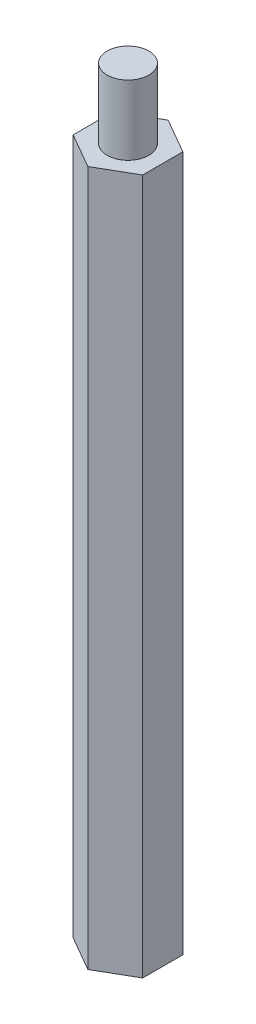
ISO-10303-21;
HEADER;
FILE_DESCRIPTION(('STEP AP214'),'2;1');
FILE_NAME('part.step','',(''),(''),'','','');
FILE_SCHEMA(('AUTOMOTIVE_DESIGN { 1 0 10303 214 1 1 1 1 }'));
ENDSEC;
DATA;
#1=APPLICATION_CONTEXT('core data for automotive mechanical design processes');
#2=APPLICATION_PROTOCOL_DEFINITION('international standard','automotive_design',2000,#1);
#3=PRODUCT_CONTEXT('',#1,'mechanical');
#4=PRODUCT('Part','Part','',(#3));
#5=PRODUCT_RELATED_PRODUCT_CATEGORY('part','',(#4));
#6=PRODUCT_DEFINITION_FORMATION('','',#4);
#7=PRODUCT_DEFINITION_CONTEXT('part definition',#1,'design');
#8=PRODUCT_DEFINITION('design','',#6,#7);
#9=PRODUCT_DEFINITION_SHAPE('','',#8);
#10=(LENGTH_UNIT() NAMED_UNIT(*) SI_UNIT(.MILLI.,.METRE.));
#11=(NAMED_UNIT(*) PLANE_ANGLE_UNIT() SI_UNIT($,.RADIAN.));
#12=(NAMED_UNIT(*) SI_UNIT($,.STERADIAN.) SOLID_ANGLE_UNIT());
#13=UNCERTAINTY_MEASURE_WITH_UNIT(LENGTH_MEASURE(1.E-05),#10,'distance_accuracy_value','');
#14=(GEOMETRIC_REPRESENTATION_CONTEXT(3) GLOBAL_UNCERTAINTY_ASSIGNED_CONTEXT((#13)) GLOBAL_UNIT_ASSIGNED_CONTEXT((#10,
#11,#12)) REPRESENTATION_CONTEXT('',''));
#15=CARTESIAN_POINT('',(0.,0.,0.));
#16=DIRECTION('',(0.,0.,1.));
#17=DIRECTION('',(1.,0.,0.));
#18=AXIS2_PLACEMENT_3D('',#15,#16,#17);
#19=CARTESIAN_POINT('',(-4.99999999999997,100.,2.88675134594819));
#20=DIRECTION('',(0.499999999999995,0.,-0.866025403784442));
#21=DIRECTION('',(-0.866025403784442,0.,-0.499999999999995));
#22=AXIS2_PLACEMENT_3D('',#19,#20,#21);
#23=PLANE('',#22);
#24=DIRECTION('',(0.866025403784442,0.,0.499999999999995));
#25=VECTOR('',#24,1.);
#26=CARTESIAN_POINT('',(-4.99999999999997,0.,2.88675134594819));
#27=LINE('',#26,#25);
#28=CARTESIAN_POINT('',(-4.99999999999997,0.,2.88675134594819));
#29=VERTEX_POINT('',#28);
#30=CARTESIAN_POINT('',(0.,0.,5.77350269189626));
#31=VERTEX_POINT('',#30);
#32=EDGE_CURVE('E117',#29,#31,#27,.T.);
#33=ORIENTED_EDGE('',*,*,#32,.T.);
#34=DIRECTION('',(0.,-1.,0.));
#35=VECTOR('',#34,1.);
#36=CARTESIAN_POINT('',(0.,100.,5.77350269189626));
#37=LINE('',#36,#35);
#38=CARTESIAN_POINT('',(0.,100.,5.77350269189626));
#39=VERTEX_POINT('',#38);
#40=EDGE_CURVE('E11',#39,#31,#37,.T.);
#41=ORIENTED_EDGE('',*,*,#40,.F.);
#42=DIRECTION('',(0.866025403784442,0.,0.499999999999995));
#43=VECTOR('',#42,1.);
#44=CARTESIAN_POINT('',(-4.99999999999997,100.,2.88675134594819));
#45=LINE('',#44,#43);
#46=CARTESIAN_POINT('',(-4.99999999999997,100.,2.88675134594819));
#47=VERTEX_POINT('',#46);
#48=EDGE_CURVE('E128',#47,#39,#45,.T.);
#49=ORIENTED_EDGE('',*,*,#48,.F.);
#50=DIRECTION('',(0.,-1.,0.));
#51=VECTOR('',#50,1.);
#52=CARTESIAN_POINT('',(-4.99999999999997,100.,2.88675134594819));
#53=LINE('',#52,#51);
#54=EDGE_CURVE('E113',#47,#29,#53,.T.);
#55=ORIENTED_EDGE('',*,*,#54,.T.);
#56=EDGE_LOOP('',(#33,#41,#49,#55));
#57=FACE_BOUND('',#56,.T.);
#58=ADVANCED_FACE('F33',(#57),#23,.F.);
#59=CARTESIAN_POINT('',(0.,100.,5.77350269189626));
#60=DIRECTION('',(-0.500000000000001,0.,-0.866025403784438));
#61=DIRECTION('',(-0.866025403784438,0.,0.500000000000001));
#62=AXIS2_PLACEMENT_3D('',#59,#60,#61);
#63=PLANE('',#62);
#64=DIRECTION('',(0.866025403784438,0.,-0.500000000000001));
#65=VECTOR('',#64,1.);
#66=CARTESIAN_POINT('',(0.,0.,5.77350269189626));
#67=LINE('',#66,#65);
#68=CARTESIAN_POINT('',(5.00000000000001,0.,2.88675134594812));
#69=VERTEX_POINT('',#68);
#70=EDGE_CURVE('E120',#31,#69,#67,.T.);
#71=ORIENTED_EDGE('',*,*,#70,.T.);
#72=DIRECTION('',(0.,-1.,0.));
#73=VECTOR('',#72,1.);
#74=CARTESIAN_POINT('',(5.00000000000001,100.,2.88675134594812));
#75=LINE('',#74,#73);
#76=CARTESIAN_POINT('',(5.00000000000001,100.,2.88675134594812));
#77=VERTEX_POINT('',#76);
#78=EDGE_CURVE('E41',#77,#69,#75,.T.);
#79=ORIENTED_EDGE('',*,*,#78,.F.);
#80=DIRECTION('',(0.866025403784438,0.,-0.500000000000001));
#81=VECTOR('',#80,1.);
#82=CARTESIAN_POINT('',(0.,100.,5.77350269189626));
#83=LINE('',#82,#81);
#84=EDGE_CURVE('E86',#39,#77,#83,.T.);
#85=ORIENTED_EDGE('',*,*,#84,.F.);
#86=ORIENTED_EDGE('',*,*,#40,.T.);
#87=EDGE_LOOP('',(#71,#79,#85,#86));
#88=FACE_BOUND('',#87,.T.);
#89=ADVANCED_FACE('F153',(#88),#63,.F.);
#90=CARTESIAN_POINT('',(5.00000000000001,100.,2.88675134594812));
#91=DIRECTION('',(-1.,0.,0.));
#92=DIRECTION('',(0.,0.,1.));
#93=AXIS2_PLACEMENT_3D('',#90,#91,#92);
#94=PLANE('',#93);
#95=DIRECTION('',(0.,0.,-1.));
#96=VECTOR('',#95,1.);
#97=CARTESIAN_POINT('',(5.00000000000001,0.,2.88675134594812));
#98=LINE('',#97,#96);
#99=CARTESIAN_POINT('',(4.99999999999999,0.,-2.88675134594815));
#100=VERTEX_POINT('',#99);
#101=EDGE_CURVE('E123',#69,#100,#98,.T.);
#102=ORIENTED_EDGE('',*,*,#101,.T.);
#103=DIRECTION('',(0.,-1.,0.));
#104=VECTOR('',#103,1.);
#105=CARTESIAN_POINT('',(4.99999999999999,100.,-2.88675134594815));
#106=LINE('',#105,#104);
#107=CARTESIAN_POINT('',(4.99999999999999,100.,-2.88675134594815));
#108=VERTEX_POINT('',#107);
#109=EDGE_CURVE('E108',#108,#100,#106,.T.);
#110=ORIENTED_EDGE('',*,*,#109,.F.);
#111=DIRECTION('',(0.,0.,-1.));
#112=VECTOR('',#111,1.);
#113=CARTESIAN_POINT('',(5.00000000000001,100.,2.88675134594812));
#114=LINE('',#113,#112);
#115=EDGE_CURVE('E99',#77,#108,#114,.T.);
#116=ORIENTED_EDGE('',*,*,#115,.F.);
#117=ORIENTED_EDGE('',*,*,#78,.T.);
#118=EDGE_LOOP('',(#102,#110,#116,#117));
#119=FACE_BOUND('',#118,.T.);
#120=ADVANCED_FACE('F134',(#119),#94,.F.);
#121=CARTESIAN_POINT('',(4.99999999999999,100.,-2.88675134594815));
#122=DIRECTION('',(-0.499999999999995,0.,0.866025403784442));
#123=DIRECTION('',(0.866025403784442,0.,0.499999999999995));
#124=AXIS2_PLACEMENT_3D('',#121,#122,#123);
#125=PLANE('',#124);
#126=DIRECTION('',(-0.866025403784441,0.,-0.499999999999995));
#127=VECTOR('',#126,1.);
#128=CARTESIAN_POINT('',(4.99999999999999,0.,-2.88675134594815));
#129=LINE('',#128,#127);
#130=CARTESIAN_POINT('',(0.,0.,-5.77350269189626));
#131=VERTEX_POINT('',#130);
#132=EDGE_CURVE('E107',#100,#131,#129,.T.);
#133=ORIENTED_EDGE('',*,*,#132,.T.);
#134=DIRECTION('',(0.,-1.,0.));
#135=VECTOR('',#134,1.);
#136=CARTESIAN_POINT('',(0.,100.,-5.77350269189626));
#137=LINE('',#136,#135);
#138=CARTESIAN_POINT('',(0.,100.,-5.77350269189626));
#139=VERTEX_POINT('',#138);
#140=EDGE_CURVE('E104',#139,#131,#137,.T.);
#141=ORIENTED_EDGE('',*,*,#140,.F.);
#142=DIRECTION('',(-0.866025403784441,0.,-0.499999999999995));
#143=VECTOR('',#142,1.);
#144=CARTESIAN_POINT('',(4.99999999999999,100.,-2.88675134594815));
#145=LINE('',#144,#143);
#146=EDGE_CURVE('E93',#108,#139,#145,.T.);
#147=ORIENTED_EDGE('',*,*,#146,.F.);
#148=ORIENTED_EDGE('',*,*,#109,.T.);
#149=EDGE_LOOP('',(#133,#141,#147,#148));
#150=FACE_BOUND('',#149,.T.);
#151=ADVANCED_FACE('F105',(#150),#125,.F.);
#152=CARTESIAN_POINT('',(0.,100.,-5.77350269189626));
#153=DIRECTION('',(0.500000000000007,0.,0.866025403784434));
#154=DIRECTION('',(0.866025403784435,0.,-0.500000000000007));
#155=AXIS2_PLACEMENT_3D('',#152,#153,#154);
#156=PLANE('',#155);
#157=DIRECTION('',(-0.866025403784434,0.,0.500000000000007));
#158=VECTOR('',#157,1.);
#159=CARTESIAN_POINT('',(0.,0.,-5.77350269189626));
#160=LINE('',#159,#158);
#161=CARTESIAN_POINT('',(-5.00000000000003,0.,-2.88675134594808));
#162=VERTEX_POINT('',#161);
#163=EDGE_CURVE('E72',#131,#162,#160,.T.);
#164=ORIENTED_EDGE('',*,*,#163,.T.);
#165=DIRECTION('',(0.,-1.,0.));
#166=VECTOR('',#165,1.);
#167=CARTESIAN_POINT('',(-5.00000000000003,100.,-2.88675134594808));
#168=LINE('',#167,#166);
#169=CARTESIAN_POINT('',(-5.00000000000003,100.,-2.88675134594808));
#170=VERTEX_POINT('',#169);
#171=EDGE_CURVE('E109',#170,#162,#168,.T.);
#172=ORIENTED_EDGE('',*,*,#171,.F.);
#173=DIRECTION('',(-0.866025403784434,0.,0.500000000000007));
#174=VECTOR('',#173,1.);
#175=CARTESIAN_POINT('',(0.,100.,-5.77350269189626));
#176=LINE('',#175,#174);
#177=EDGE_CURVE('E97',#139,#170,#176,.T.);
#178=ORIENTED_EDGE('',*,*,#177,.F.);
#179=ORIENTED_EDGE('',*,*,#140,.T.);
#180=EDGE_LOOP('',(#164,#172,#178,#179));
#181=FACE_BOUND('',#180,.T.);
#182=ADVANCED_FACE('F111',(#181),#156,.F.);
#183=CARTESIAN_POINT('',(-5.00000000000003,100.,-2.88675134594808));
#184=DIRECTION('',(1.,0.,0.));
#185=DIRECTION('',(0.,0.,-1.));
#186=AXIS2_PLACEMENT_3D('',#183,#184,#185);
#187=PLANE('',#186);
#188=DIRECTION('',(0.,0.,1.));
#189=VECTOR('',#188,1.);
#190=CARTESIAN_POINT('',(-5.00000000000003,0.,-2.88675134594808));
#191=LINE('',#190,#189);
#192=EDGE_CURVE('E78',#162,#29,#191,.T.);
#193=ORIENTED_EDGE('',*,*,#192,.T.);
#194=ORIENTED_EDGE('',*,*,#54,.F.);
#195=DIRECTION('',(0.,0.,1.));
#196=VECTOR('',#195,1.);
#197=CARTESIAN_POINT('',(-5.00000000000003,100.,-2.88675134594808));
#198=LINE('',#197,#196);
#199=EDGE_CURVE('E49',#170,#47,#198,.T.);
#200=ORIENTED_EDGE('',*,*,#199,.F.);
#201=ORIENTED_EDGE('',*,*,#171,.T.);
#202=EDGE_LOOP('',(#193,#194,#200,#201));
#203=FACE_BOUND('',#202,.T.);
#204=ADVANCED_FACE('F141',(#203),#187,.F.);
#205=CARTESIAN_POINT('',(0.,100.,0.));
#206=DIRECTION('',(0.,1.,0.));
#207=DIRECTION('',(0.,0.,1.));
#208=AXIS2_PLACEMENT_3D('',#205,#206,#207);
#209=PLANE('',#208);
#210=CARTESIAN_POINT('',(0.,100.,0.));
#211=DIRECTION('',(0.,1.,0.));
#212=DIRECTION('',(0.,0.,1.));
#213=AXIS2_PLACEMENT_3D('',#210,#211,#212);
#214=CIRCLE('',#213,3.);
#215=CARTESIAN_POINT('',(0.,100.,3.));
#216=VERTEX_POINT('',#215);
#217=EDGE_CURVE('E236',#216,#216,#214,.T.);
#218=ORIENTED_EDGE('',*,*,#217,.F.);
#219=EDGE_LOOP('',(#218));
#220=FACE_BOUND('',#219,.T.);
#221=ORIENTED_EDGE('',*,*,#48,.T.);
#222=ORIENTED_EDGE('',*,*,#84,.T.);
#223=ORIENTED_EDGE('',*,*,#115,.T.);
#224=ORIENTED_EDGE('',*,*,#146,.T.);
#225=ORIENTED_EDGE('',*,*,#177,.T.);
#226=ORIENTED_EDGE('',*,*,#199,.T.);
#227=EDGE_LOOP('',(#221,#222,#223,#224,#225,#226));
#228=FACE_BOUND('',#227,.T.);
#229=ADVANCED_FACE('F95',(#220,#228),#209,.T.);
#230=CARTESIAN_POINT('',(0.,0.,0.));
#231=DIRECTION('',(0.,1.,0.));
#232=DIRECTION('',(0.,0.,1.));
#233=AXIS2_PLACEMENT_3D('',#230,#231,#232);
#234=PLANE('',#233);
#235=CARTESIAN_POINT('',(0.,0.,0.));
#236=DIRECTION('',(0.,-1.,0.));
#237=DIRECTION('',(0.,0.,-1.));
#238=AXIS2_PLACEMENT_3D('',#235,#236,#237);
#239=CIRCLE('',#238,3.);
#240=CARTESIAN_POINT('',(0.,0.,-3.));
#241=VERTEX_POINT('',#240);
#242=EDGE_CURVE('E237',#241,#241,#239,.T.);
#243=ORIENTED_EDGE('',*,*,#242,.F.);
#244=EDGE_LOOP('',(#243));
#245=FACE_BOUND('',#244,.T.);
#246=ORIENTED_EDGE('',*,*,#32,.F.);
#247=ORIENTED_EDGE('',*,*,#192,.F.);
#248=ORIENTED_EDGE('',*,*,#163,.F.);
#249=ORIENTED_EDGE('',*,*,#132,.F.);
#250=ORIENTED_EDGE('',*,*,#101,.F.);
#251=ORIENTED_EDGE('',*,*,#70,.F.);
#252=EDGE_LOOP('',(#246,#247,#248,#249,#250,#251));
#253=FACE_BOUND('',#252,.T.);
#254=ADVANCED_FACE('F137',(#245,#253),#234,.F.);
#255=CARTESIAN_POINT('',(0.,110.,0.));
#256=DIRECTION('',(0.,-1.,0.));
#257=DIRECTION('',(0.,0.,-1.));
#258=AXIS2_PLACEMENT_3D('',#255,#256,#257);
#259=CYLINDRICAL_SURFACE('',#258,3.);
#260=CARTESIAN_POINT('',(0.,110.,0.));
#261=DIRECTION('',(0.,1.,0.));
#262=DIRECTION('',(0.,0.,1.));
#263=AXIS2_PLACEMENT_3D('',#260,#261,#262);
#264=CIRCLE('',#263,3.);
#265=CARTESIAN_POINT('',(0.,110.,3.));
#266=VERTEX_POINT('',#265);
#267=EDGE_CURVE('E121',#266,#266,#264,.T.);
#268=ORIENTED_EDGE('',*,*,#267,.F.);
#269=EDGE_LOOP('',(#268));
#270=FACE_BOUND('',#269,.T.);
#271=ORIENTED_EDGE('',*,*,#217,.T.);
#272=EDGE_LOOP('',(#271));
#273=FACE_BOUND('',#272,.T.);
#274=ADVANCED_FACE('F188',(#270,#273),#259,.T.);
#275=CARTESIAN_POINT('',(0.,110.,0.));
#276=DIRECTION('',(0.,1.,0.));
#277=DIRECTION('',(0.,0.,1.));
#278=AXIS2_PLACEMENT_3D('',#275,#276,#277);
#279=PLANE('',#278);
#280=ORIENTED_EDGE('',*,*,#267,.T.);
#281=EDGE_LOOP('',(#280));
#282=FACE_BOUND('',#281,.T.);
#283=ADVANCED_FACE('F193',(#282),#279,.T.);
#284=CARTESIAN_POINT('',(0.,12.,0.));
#285=DIRECTION('',(0.,-1.,0.));
#286=DIRECTION('',(0.,0.,-1.));
#287=AXIS2_PLACEMENT_3D('',#284,#285,#286);
#288=CYLINDRICAL_SURFACE('',#287,3.);
#289=CARTESIAN_POINT('',(0.,12.,0.));
#290=DIRECTION('',(0.,-1.,0.));
#291=DIRECTION('',(0.,0.,-1.));
#292=AXIS2_PLACEMENT_3D('',#289,#290,#291);
#293=CIRCLE('',#292,3.);
#294=CARTESIAN_POINT('',(0.,12.,-3.));
#295=VERTEX_POINT('',#294);
#296=EDGE_CURVE('E235',#295,#295,#293,.T.);
#297=ORIENTED_EDGE('',*,*,#296,.F.);
#298=EDGE_LOOP('',(#297));
#299=FACE_BOUND('',#298,.T.);
#300=ORIENTED_EDGE('',*,*,#242,.T.);
#301=EDGE_LOOP('',(#300));
#302=FACE_BOUND('',#301,.T.);
#303=ADVANCED_FACE('F203',(#299,#302),#288,.F.);
#304=CARTESIAN_POINT('',(0.,12.,0.));
#305=DIRECTION('',(0.,-1.,0.));
#306=DIRECTION('',(0.,0.,-1.));
#307=AXIS2_PLACEMENT_3D('',#304,#305,#306);
#308=PLANE('',#307);
#309=ORIENTED_EDGE('',*,*,#296,.T.);
#310=EDGE_LOOP('',(#309));
#311=FACE_BOUND('',#310,.T.);
#312=ADVANCED_FACE('F219',(#311),#308,.T.);
#313=CLOSED_SHELL('',(#58,#89,#120,#151,#182,#204,#229,#254,#274,#283,#303,#312));
#314=MANIFOLD_SOLID_BREP('B2',#313);
#315=ADVANCED_BREP_SHAPE_REPRESENTATION('',(#18,#314),#14);
#316=SHAPE_DEFINITION_REPRESENTATION(#9,#315);
ENDSEC;
END-ISO-10303-21;
